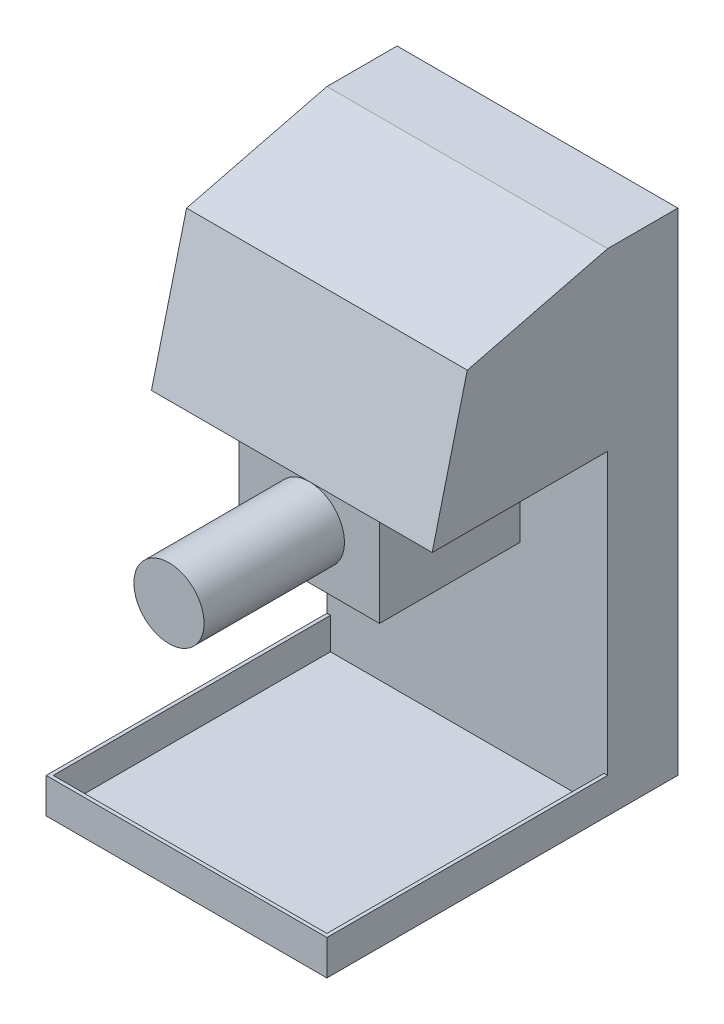
ISO-10303-21;
HEADER;
FILE_DESCRIPTION(('STEP AP214'),'2;1');
FILE_NAME('part.step','',(''),(''),'','','');
FILE_SCHEMA(('AUTOMOTIVE_DESIGN { 1 0 10303 214 1 1 1 1 }'));
ENDSEC;
DATA;
#1=APPLICATION_CONTEXT('core data for automotive mechanical design processes');
#2=APPLICATION_PROTOCOL_DEFINITION('international standard','automotive_design',2000,#1);
#3=PRODUCT_CONTEXT('',#1,'mechanical');
#4=PRODUCT('Part','Part','',(#3));
#5=PRODUCT_RELATED_PRODUCT_CATEGORY('part','',(#4));
#6=PRODUCT_DEFINITION_FORMATION('','',#4);
#7=PRODUCT_DEFINITION_CONTEXT('part definition',#1,'design');
#8=PRODUCT_DEFINITION('design','',#6,#7);
#9=PRODUCT_DEFINITION_SHAPE('','',#8);
#10=(LENGTH_UNIT() NAMED_UNIT(*) SI_UNIT(.MILLI.,.METRE.));
#11=(NAMED_UNIT(*) PLANE_ANGLE_UNIT() SI_UNIT($,.RADIAN.));
#12=(NAMED_UNIT(*) SI_UNIT($,.STERADIAN.) SOLID_ANGLE_UNIT());
#13=UNCERTAINTY_MEASURE_WITH_UNIT(LENGTH_MEASURE(1.E-05),#10,'distance_accuracy_value','');
#14=(GEOMETRIC_REPRESENTATION_CONTEXT(3) GLOBAL_UNCERTAINTY_ASSIGNED_CONTEXT((#13)) GLOBAL_UNIT_ASSIGNED_CONTEXT((#10,
#11,#12)) REPRESENTATION_CONTEXT('',''));
#15=CARTESIAN_POINT('',(0.,0.,0.));
#16=DIRECTION('',(0.,0.,1.));
#17=DIRECTION('',(1.,0.,0.));
#18=AXIS2_PLACEMENT_3D('',#15,#16,#17);
#19=CARTESIAN_POINT('',(60.,60.,65.));
#20=DIRECTION('',(0.,0.,-1.));
#21=DIRECTION('',(-1.,0.,0.));
#22=AXIS2_PLACEMENT_3D('',#19,#20,#21);
#23=PLANE('',#22);
#24=DIRECTION('',(-1.,0.,0.));
#25=VECTOR('',#24,1.);
#26=CARTESIAN_POINT('',(60.,90.,65.));
#27=LINE('',#26,#25);
#28=CARTESIAN_POINT('',(60.,90.,65.));
#29=VERTEX_POINT('',#28);
#30=CARTESIAN_POINT('',(20.,90.,65.));
#31=VERTEX_POINT('',#30);
#32=EDGE_CURVE('E60',#29,#31,#27,.T.);
#33=ORIENTED_EDGE('',*,*,#32,.T.);
#34=DIRECTION('',(0.,1.,0.));
#35=VECTOR('',#34,1.);
#36=CARTESIAN_POINT('',(20.,60.,65.));
#37=LINE('',#36,#35);
#38=CARTESIAN_POINT('',(20.,60.,65.));
#39=VERTEX_POINT('',#38);
#40=EDGE_CURVE('E226',#39,#31,#37,.T.);
#41=ORIENTED_EDGE('',*,*,#40,.F.);
#42=DIRECTION('',(-1.,0.,0.));
#43=VECTOR('',#42,1.);
#44=CARTESIAN_POINT('',(60.,60.,65.));
#45=LINE('',#44,#43);
#46=CARTESIAN_POINT('',(60.,60.,65.));
#47=VERTEX_POINT('',#46);
#48=EDGE_CURVE('E286',#47,#39,#45,.T.);
#49=ORIENTED_EDGE('',*,*,#48,.F.);
#50=DIRECTION('',(0.,1.,0.));
#51=VECTOR('',#50,1.);
#52=CARTESIAN_POINT('',(60.,60.,65.));
#53=LINE('',#52,#51);
#54=EDGE_CURVE('E222',#47,#29,#53,.T.);
#55=ORIENTED_EDGE('',*,*,#54,.T.);
#56=EDGE_LOOP('',(#33,#41,#49,#55));
#57=FACE_BOUND('',#56,.T.);
#58=CARTESIAN_POINT('',(40.,75.,65.));
#59=DIRECTION('',(0.,0.,-1.));
#60=DIRECTION('',(-1.,0.,0.));
#61=AXIS2_PLACEMENT_3D('',#58,#59,#60);
#62=CIRCLE('',#61,10.);
#63=CARTESIAN_POINT('',(30.,75.,65.));
#64=VERTEX_POINT('',#63);
#65=EDGE_CURVE('E12',#64,#64,#62,.F.);
#66=ORIENTED_EDGE('',*,*,#65,.F.);
#67=EDGE_LOOP('',(#66));
#68=FACE_BOUND('',#67,.T.);
#69=ADVANCED_FACE('F37',(#57,#68),#23,.F.);
#70=CARTESIAN_POINT('',(80.,90.,70.));
#71=DIRECTION('',(0.,1.,0.));
#72=DIRECTION('',(0.,0.,1.));
#73=AXIS2_PLACEMENT_3D('',#70,#71,#72);
#74=PLANE('',#73);
#75=DIRECTION('',(0.,0.,-1.));
#76=VECTOR('',#75,1.);
#77=CARTESIAN_POINT('',(0.,90.,70.));
#78=LINE('',#77,#76);
#79=CARTESIAN_POINT('',(0.,90.,70.));
#80=VERTEX_POINT('',#79);
#81=CARTESIAN_POINT('',(0.,90.,20.));
#82=VERTEX_POINT('',#81);
#83=EDGE_CURVE('E237',#80,#82,#78,.T.);
#84=ORIENTED_EDGE('',*,*,#83,.T.);
#85=DIRECTION('',(-1.,0.,0.));
#86=VECTOR('',#85,1.);
#87=CARTESIAN_POINT('',(80.,90.,20.));
#88=LINE('',#87,#86);
#89=CARTESIAN_POINT('',(80.,90.,20.));
#90=VERTEX_POINT('',#89);
#91=EDGE_CURVE('E187',#90,#82,#88,.T.);
#92=ORIENTED_EDGE('',*,*,#91,.F.);
#93=DIRECTION('',(0.,0.,-1.));
#94=VECTOR('',#93,1.);
#95=CARTESIAN_POINT('',(80.,90.,70.));
#96=LINE('',#95,#94);
#97=CARTESIAN_POINT('',(80.,90.,70.));
#98=VERTEX_POINT('',#97);
#99=EDGE_CURVE('E250',#98,#90,#96,.T.);
#100=ORIENTED_EDGE('',*,*,#99,.F.);
#101=DIRECTION('',(-1.,0.,0.));
#102=VECTOR('',#101,1.);
#103=CARTESIAN_POINT('',(80.,90.,70.));
#104=LINE('',#103,#102);
#105=EDGE_CURVE('E194',#98,#80,#104,.T.);
#106=ORIENTED_EDGE('',*,*,#105,.T.);
#107=EDGE_LOOP('',(#84,#92,#100,#106));
#108=FACE_BOUND('',#107,.T.);
#109=DIRECTION('',(0.,0.,1.));
#110=VECTOR('',#109,1.);
#111=CARTESIAN_POINT('',(60.,90.,65.));
#112=LINE('',#111,#110);
#113=CARTESIAN_POINT('',(60.,90.,25.));
#114=VERTEX_POINT('',#113);
#115=EDGE_CURVE('E279',#114,#29,#112,.T.);
#116=ORIENTED_EDGE('',*,*,#115,.F.);
#117=DIRECTION('',(1.,0.,0.));
#118=VECTOR('',#117,1.);
#119=CARTESIAN_POINT('',(60.,90.,25.));
#120=LINE('',#119,#118);
#121=CARTESIAN_POINT('',(20.,90.,25.));
#122=VERTEX_POINT('',#121);
#123=EDGE_CURVE('E271',#122,#114,#120,.T.);
#124=ORIENTED_EDGE('',*,*,#123,.F.);
#125=DIRECTION('',(0.,0.,-1.));
#126=VECTOR('',#125,1.);
#127=CARTESIAN_POINT('',(20.,90.,65.));
#128=LINE('',#127,#126);
#129=EDGE_CURVE('E275',#31,#122,#128,.T.);
#130=ORIENTED_EDGE('',*,*,#129,.F.);
#131=ORIENTED_EDGE('',*,*,#32,.F.);
#132=EDGE_LOOP('',(#116,#124,#130,#131));
#133=FACE_BOUND('',#132,.T.);
#134=ADVANCED_FACE('F335',(#108,#133),#74,.F.);
#135=CARTESIAN_POINT('',(80.,0.,100.));
#136=DIRECTION('',(0.,1.,0.));
#137=DIRECTION('',(0.,0.,1.));
#138=AXIS2_PLACEMENT_3D('',#135,#136,#137);
#139=PLANE('',#138);
#140=DIRECTION('',(0.,0.,-1.));
#141=VECTOR('',#140,1.);
#142=CARTESIAN_POINT('',(0.,0.,100.));
#143=LINE('',#142,#141);
#144=CARTESIAN_POINT('',(0.,0.,100.));
#145=VERTEX_POINT('',#144);
#146=CARTESIAN_POINT('',(0.,0.,0.));
#147=VERTEX_POINT('',#146);
#148=EDGE_CURVE('E218',#145,#147,#143,.T.);
#149=ORIENTED_EDGE('',*,*,#148,.T.);
#150=DIRECTION('',(-1.,0.,0.));
#151=VECTOR('',#150,1.);
#152=CARTESIAN_POINT('',(80.,0.,0.));
#153=LINE('',#152,#151);
#154=CARTESIAN_POINT('',(80.,0.,0.));
#155=VERTEX_POINT('',#154);
#156=EDGE_CURVE('E45',#155,#147,#153,.T.);
#157=ORIENTED_EDGE('',*,*,#156,.F.);
#158=DIRECTION('',(0.,0.,-1.));
#159=VECTOR('',#158,1.);
#160=CARTESIAN_POINT('',(80.,0.,100.));
#161=LINE('',#160,#159);
#162=CARTESIAN_POINT('',(80.,0.,100.));
#163=VERTEX_POINT('',#162);
#164=EDGE_CURVE('E243',#163,#155,#161,.T.);
#165=ORIENTED_EDGE('',*,*,#164,.F.);
#166=DIRECTION('',(-1.,0.,0.));
#167=VECTOR('',#166,1.);
#168=CARTESIAN_POINT('',(80.,0.,100.));
#169=LINE('',#168,#167);
#170=EDGE_CURVE('E189',#163,#145,#169,.T.);
#171=ORIENTED_EDGE('',*,*,#170,.T.);
#172=EDGE_LOOP('',(#149,#157,#165,#171));
#173=FACE_BOUND('',#172,.T.);
#174=ADVANCED_FACE('F39',(#173),#139,.F.);
#175=CARTESIAN_POINT('',(80.,0.,0.));
#176=DIRECTION('',(0.,0.,1.));
#177=DIRECTION('',(1.,0.,0.));
#178=AXIS2_PLACEMENT_3D('',#175,#176,#177);
#179=PLANE('',#178);
#180=DIRECTION('',(0.,1.,0.));
#181=VECTOR('',#180,1.);
#182=CARTESIAN_POINT('',(0.,0.,0.));
#183=LINE('',#182,#181);
#184=CARTESIAN_POINT('',(0.,140.,0.));
#185=VERTEX_POINT('',#184);
#186=EDGE_CURVE('E211',#147,#185,#183,.T.);
#187=ORIENTED_EDGE('',*,*,#186,.T.);
#188=DIRECTION('',(-1.,0.,0.));
#189=VECTOR('',#188,1.);
#190=CARTESIAN_POINT('',(80.,140.,0.));
#191=LINE('',#190,#189);
#192=CARTESIAN_POINT('',(80.,140.,0.));
#193=VERTEX_POINT('',#192);
#194=EDGE_CURVE('E203',#193,#185,#191,.T.);
#195=ORIENTED_EDGE('',*,*,#194,.F.);
#196=DIRECTION('',(0.,1.,0.));
#197=VECTOR('',#196,1.);
#198=CARTESIAN_POINT('',(80.,0.,0.));
#199=LINE('',#198,#197);
#200=EDGE_CURVE('E212',#155,#193,#199,.T.);
#201=ORIENTED_EDGE('',*,*,#200,.F.);
#202=ORIENTED_EDGE('',*,*,#156,.T.);
#203=EDGE_LOOP('',(#187,#195,#201,#202));
#204=FACE_BOUND('',#203,.T.);
#205=ADVANCED_FACE('F209',(#204),#179,.F.);
#206=CARTESIAN_POINT('',(80.,140.,0.));
#207=DIRECTION('',(0.,-1.,0.));
#208=DIRECTION('',(0.,0.,-1.));
#209=AXIS2_PLACEMENT_3D('',#206,#207,#208);
#210=PLANE('',#209);
#211=DIRECTION('',(0.,0.,1.));
#212=VECTOR('',#211,1.);
#213=CARTESIAN_POINT('',(0.,140.,0.));
#214=LINE('',#213,#212);
#215=CARTESIAN_POINT('',(0.,140.,20.));
#216=VERTEX_POINT('',#215);
#217=EDGE_CURVE('E224',#185,#216,#214,.T.);
#218=ORIENTED_EDGE('',*,*,#217,.T.);
#219=DIRECTION('',(-1.,0.,0.));
#220=VECTOR('',#219,1.);
#221=CARTESIAN_POINT('',(80.,140.,20.));
#222=LINE('',#221,#220);
#223=CARTESIAN_POINT('',(80.,140.,20.));
#224=VERTEX_POINT('',#223);
#225=EDGE_CURVE('E200',#224,#216,#222,.T.);
#226=ORIENTED_EDGE('',*,*,#225,.F.);
#227=DIRECTION('',(0.,0.,1.));
#228=VECTOR('',#227,1.);
#229=CARTESIAN_POINT('',(80.,140.,0.));
#230=LINE('',#229,#228);
#231=EDGE_CURVE('E258',#193,#224,#230,.T.);
#232=ORIENTED_EDGE('',*,*,#231,.F.);
#233=ORIENTED_EDGE('',*,*,#194,.T.);
#234=EDGE_LOOP('',(#218,#226,#232,#233));
#235=FACE_BOUND('',#234,.T.);
#236=ADVANCED_FACE('F320',(#235),#210,.F.);
#237=CARTESIAN_POINT('',(80.,140.,20.));
#238=DIRECTION('',(0.,-0.970142500145332,-0.242535625036333));
#239=DIRECTION('',(0.,0.242535625036333,-0.970142500145332));
#240=AXIS2_PLACEMENT_3D('',#237,#238,#239);
#241=PLANE('',#240);
#242=DIRECTION('',(0.,-0.242535625036333,0.970142500145332));
#243=VECTOR('',#242,1.);
#244=CARTESIAN_POINT('',(0.,140.,20.));
#245=LINE('',#244,#243);
#246=CARTESIAN_POINT('',(0.,130.,60.));
#247=VERTEX_POINT('',#246);
#248=EDGE_CURVE('E233',#216,#247,#245,.T.);
#249=ORIENTED_EDGE('',*,*,#248,.T.);
#250=DIRECTION('',(-1.,0.,0.));
#251=VECTOR('',#250,1.);
#252=CARTESIAN_POINT('',(80.,130.,60.));
#253=LINE('',#252,#251);
#254=CARTESIAN_POINT('',(80.,130.,60.));
#255=VERTEX_POINT('',#254);
#256=EDGE_CURVE('E197',#255,#247,#253,.T.);
#257=ORIENTED_EDGE('',*,*,#256,.F.);
#258=DIRECTION('',(0.,-0.242535625036333,0.970142500145332));
#259=VECTOR('',#258,1.);
#260=CARTESIAN_POINT('',(80.,140.,20.));
#261=LINE('',#260,#259);
#262=EDGE_CURVE('E256',#224,#255,#261,.T.);
#263=ORIENTED_EDGE('',*,*,#262,.F.);
#264=ORIENTED_EDGE('',*,*,#225,.T.);
#265=EDGE_LOOP('',(#249,#257,#263,#264));
#266=FACE_BOUND('',#265,.T.);
#267=ADVANCED_FACE('F325',(#266),#241,.F.);
#268=CARTESIAN_POINT('',(80.,130.,60.));
#269=DIRECTION('',(0.,-0.242535625036332,-0.970142500145332));
#270=DIRECTION('',(0.,0.970142500145332,-0.242535625036332));
#271=AXIS2_PLACEMENT_3D('',#268,#269,#270);
#272=PLANE('',#271);
#273=DIRECTION('',(0.,-0.970142500145332,0.242535625036332));
#274=VECTOR('',#273,1.);
#275=CARTESIAN_POINT('',(0.,130.,60.));
#276=LINE('',#275,#274);
#277=EDGE_CURVE('E235',#247,#80,#276,.T.);
#278=ORIENTED_EDGE('',*,*,#277,.T.);
#279=ORIENTED_EDGE('',*,*,#105,.F.);
#280=DIRECTION('',(0.,-0.970142500145332,0.242535625036332));
#281=VECTOR('',#280,1.);
#282=CARTESIAN_POINT('',(80.,130.,60.));
#283=LINE('',#282,#281);
#284=EDGE_CURVE('E254',#255,#98,#283,.T.);
#285=ORIENTED_EDGE('',*,*,#284,.F.);
#286=ORIENTED_EDGE('',*,*,#256,.T.);
#287=EDGE_LOOP('',(#278,#279,#285,#286));
#288=FACE_BOUND('',#287,.T.);
#289=ADVANCED_FACE('F331',(#288),#272,.F.);
#290=CARTESIAN_POINT('',(80.,90.,20.));
#291=DIRECTION('',(0.,0.,-1.));
#292=DIRECTION('',(0.,1.,0.));
#293=AXIS2_PLACEMENT_3D('',#290,#291,#292);
#294=PLANE('',#293);
#295=DIRECTION('',(0.,-1.,0.));
#296=VECTOR('',#295,1.);
#297=CARTESIAN_POINT('',(0.,90.,20.));
#298=LINE('',#297,#296);
#299=CARTESIAN_POINT('',(0.,10.,20.));
#300=VERTEX_POINT('',#299);
#301=EDGE_CURVE('E182',#82,#300,#298,.T.);
#302=ORIENTED_EDGE('',*,*,#301,.T.);
#303=DIRECTION('',(-1.,0.,0.));
#304=VECTOR('',#303,1.);
#305=CARTESIAN_POINT('',(80.,10.,20.));
#306=LINE('',#305,#304);
#307=CARTESIAN_POINT('',(1.,10.,20.));
#308=VERTEX_POINT('',#307);
#309=EDGE_CURVE('E174',#308,#300,#306,.T.);
#310=ORIENTED_EDGE('',*,*,#309,.F.);
#311=DIRECTION('',(0.,1.,0.));
#312=VECTOR('',#311,1.);
#313=CARTESIAN_POINT('',(1.,-111.018016555873,20.));
#314=LINE('',#313,#312);
#315=CARTESIAN_POINT('',(1.,1.,20.));
#316=VERTEX_POINT('',#315);
#317=EDGE_CURVE('E157',#316,#308,#314,.T.);
#318=ORIENTED_EDGE('',*,*,#317,.F.);
#319=DIRECTION('',(1.,0.,0.));
#320=VECTOR('',#319,1.);
#321=CARTESIAN_POINT('',(79.,1.,20.));
#322=LINE('',#321,#320);
#323=CARTESIAN_POINT('',(79.,1.,20.));
#324=VERTEX_POINT('',#323);
#325=EDGE_CURVE('E292',#316,#324,#322,.T.);
#326=ORIENTED_EDGE('',*,*,#325,.T.);
#327=DIRECTION('',(0.,1.,0.));
#328=VECTOR('',#327,1.);
#329=CARTESIAN_POINT('',(79.,-111.018016555873,20.));
#330=LINE('',#329,#328);
#331=CARTESIAN_POINT('',(79.,10.,20.));
#332=VERTEX_POINT('',#331);
#333=EDGE_CURVE('E169',#324,#332,#330,.T.);
#334=ORIENTED_EDGE('',*,*,#333,.T.);
#335=CARTESIAN_POINT('',(80.,10.,20.));
#336=VERTEX_POINT('',#335);
#337=EDGE_CURVE('E184',#336,#332,#306,.T.);
#338=ORIENTED_EDGE('',*,*,#337,.F.);
#339=DIRECTION('',(0.,-1.,0.));
#340=VECTOR('',#339,1.);
#341=CARTESIAN_POINT('',(80.,90.,20.));
#342=LINE('',#341,#340);
#343=EDGE_CURVE('E247',#90,#336,#342,.T.);
#344=ORIENTED_EDGE('',*,*,#343,.F.);
#345=ORIENTED_EDGE('',*,*,#91,.T.);
#346=EDGE_LOOP('',(#302,#310,#318,#326,#334,#338,#344,#345));
#347=FACE_BOUND('',#346,.T.);
#348=ADVANCED_FACE('F179',(#347),#294,.F.);
#349=CARTESIAN_POINT('',(80.,10.,20.));
#350=DIRECTION('',(0.,-1.,0.));
#351=DIRECTION('',(0.,0.,-1.));
#352=AXIS2_PLACEMENT_3D('',#349,#350,#351);
#353=PLANE('',#352);
#354=ORIENTED_EDGE('',*,*,#337,.T.);
#355=DIRECTION('',(0.,0.,-1.));
#356=VECTOR('',#355,1.);
#357=CARTESIAN_POINT('',(79.,10.,20.));
#358=LINE('',#357,#356);
#359=CARTESIAN_POINT('',(79.,10.,99.));
#360=VERTEX_POINT('',#359);
#361=EDGE_CURVE('E52',#360,#332,#358,.T.);
#362=ORIENTED_EDGE('',*,*,#361,.F.);
#363=DIRECTION('',(1.,0.,0.));
#364=VECTOR('',#363,1.);
#365=CARTESIAN_POINT('',(79.,10.,99.));
#366=LINE('',#365,#364);
#367=CARTESIAN_POINT('',(1.00000000000001,10.,99.));
#368=VERTEX_POINT('',#367);
#369=EDGE_CURVE('E177',#368,#360,#366,.T.);
#370=ORIENTED_EDGE('',*,*,#369,.F.);
#371=DIRECTION('',(0.,0.,1.));
#372=VECTOR('',#371,1.);
#373=CARTESIAN_POINT('',(1.,10.,20.));
#374=LINE('',#373,#372);
#375=EDGE_CURVE('E161',#308,#368,#374,.T.);
#376=ORIENTED_EDGE('',*,*,#375,.F.);
#377=ORIENTED_EDGE('',*,*,#309,.T.);
#378=DIRECTION('',(0.,0.,1.));
#379=VECTOR('',#378,1.);
#380=CARTESIAN_POINT('',(0.,10.,20.));
#381=LINE('',#380,#379);
#382=CARTESIAN_POINT('',(0.,10.,100.));
#383=VERTEX_POINT('',#382);
#384=EDGE_CURVE('E240',#300,#383,#381,.T.);
#385=ORIENTED_EDGE('',*,*,#384,.T.);
#386=DIRECTION('',(-1.,0.,0.));
#387=VECTOR('',#386,1.);
#388=CARTESIAN_POINT('',(80.,10.,100.));
#389=LINE('',#388,#387);
#390=CARTESIAN_POINT('',(80.,10.,100.));
#391=VERTEX_POINT('',#390);
#392=EDGE_CURVE('E185',#391,#383,#389,.T.);
#393=ORIENTED_EDGE('',*,*,#392,.F.);
#394=DIRECTION('',(0.,0.,1.));
#395=VECTOR('',#394,1.);
#396=CARTESIAN_POINT('',(80.,10.,20.));
#397=LINE('',#396,#395);
#398=EDGE_CURVE('E244',#336,#391,#397,.T.);
#399=ORIENTED_EDGE('',*,*,#398,.F.);
#400=EDGE_LOOP('',(#354,#362,#370,#376,#377,#385,#393,#399));
#401=FACE_BOUND('',#400,.T.);
#402=ADVANCED_FACE('F173',(#401),#353,.F.);
#403=CARTESIAN_POINT('',(80.,10.,100.));
#404=DIRECTION('',(0.,0.,-1.));
#405=DIRECTION('',(-1.,0.,0.));
#406=AXIS2_PLACEMENT_3D('',#403,#404,#405);
#407=PLANE('',#406);
#408=DIRECTION('',(0.,-1.,0.));
#409=VECTOR('',#408,1.);
#410=CARTESIAN_POINT('',(0.,10.,100.));
#411=LINE('',#410,#409);
#412=EDGE_CURVE('E242',#383,#145,#411,.T.);
#413=ORIENTED_EDGE('',*,*,#412,.T.);
#414=ORIENTED_EDGE('',*,*,#170,.F.);
#415=DIRECTION('',(0.,-1.,0.));
#416=VECTOR('',#415,1.);
#417=CARTESIAN_POINT('',(80.,10.,100.));
#418=LINE('',#417,#416);
#419=EDGE_CURVE('E229',#391,#163,#418,.T.);
#420=ORIENTED_EDGE('',*,*,#419,.F.);
#421=ORIENTED_EDGE('',*,*,#392,.T.);
#422=EDGE_LOOP('',(#413,#414,#420,#421));
#423=FACE_BOUND('',#422,.T.);
#424=ADVANCED_FACE('F314',(#423),#407,.F.);
#425=CARTESIAN_POINT('',(80.,0.,0.));
#426=DIRECTION('',(1.,0.,0.));
#427=DIRECTION('',(0.,0.,-1.));
#428=AXIS2_PLACEMENT_3D('',#425,#426,#427);
#429=PLANE('',#428);
#430=ORIENTED_EDGE('',*,*,#164,.T.);
#431=ORIENTED_EDGE('',*,*,#200,.T.);
#432=ORIENTED_EDGE('',*,*,#231,.T.);
#433=ORIENTED_EDGE('',*,*,#262,.T.);
#434=ORIENTED_EDGE('',*,*,#284,.T.);
#435=ORIENTED_EDGE('',*,*,#99,.T.);
#436=ORIENTED_EDGE('',*,*,#343,.T.);
#437=ORIENTED_EDGE('',*,*,#398,.T.);
#438=ORIENTED_EDGE('',*,*,#419,.T.);
#439=EDGE_LOOP('',(#430,#431,#432,#433,#434,#435,#436,#437,#438));
#440=FACE_BOUND('',#439,.T.);
#441=ADVANCED_FACE('F315',(#440),#429,.T.);
#442=CARTESIAN_POINT('',(0.,0.,0.));
#443=DIRECTION('',(1.,0.,0.));
#444=DIRECTION('',(0.,0.,-1.));
#445=AXIS2_PLACEMENT_3D('',#442,#443,#444);
#446=PLANE('',#445);
#447=ORIENTED_EDGE('',*,*,#148,.F.);
#448=ORIENTED_EDGE('',*,*,#412,.F.);
#449=ORIENTED_EDGE('',*,*,#384,.F.);
#450=ORIENTED_EDGE('',*,*,#301,.F.);
#451=ORIENTED_EDGE('',*,*,#83,.F.);
#452=ORIENTED_EDGE('',*,*,#277,.F.);
#453=ORIENTED_EDGE('',*,*,#248,.F.);
#454=ORIENTED_EDGE('',*,*,#217,.F.);
#455=ORIENTED_EDGE('',*,*,#186,.F.);
#456=EDGE_LOOP('',(#447,#448,#449,#450,#451,#452,#453,#454,#455));
#457=FACE_BOUND('',#456,.T.);
#458=ADVANCED_FACE('F336',(#457),#446,.F.);
#459=CARTESIAN_POINT('',(60.,60.,65.));
#460=DIRECTION('',(-1.,0.,0.));
#461=DIRECTION('',(0.,0.,1.));
#462=AXIS2_PLACEMENT_3D('',#459,#460,#461);
#463=PLANE('',#462);
#464=ORIENTED_EDGE('',*,*,#115,.T.);
#465=ORIENTED_EDGE('',*,*,#54,.F.);
#466=DIRECTION('',(0.,0.,1.));
#467=VECTOR('',#466,1.);
#468=CARTESIAN_POINT('',(60.,60.,65.));
#469=LINE('',#468,#467);
#470=CARTESIAN_POINT('',(60.,60.,25.));
#471=VERTEX_POINT('',#470);
#472=EDGE_CURVE('E274',#471,#47,#469,.T.);
#473=ORIENTED_EDGE('',*,*,#472,.F.);
#474=DIRECTION('',(0.,1.,0.));
#475=VECTOR('',#474,1.);
#476=CARTESIAN_POINT('',(60.,60.,25.));
#477=LINE('',#476,#475);
#478=EDGE_CURVE('E267',#471,#114,#477,.T.);
#479=ORIENTED_EDGE('',*,*,#478,.T.);
#480=EDGE_LOOP('',(#464,#465,#473,#479));
#481=FACE_BOUND('',#480,.T.);
#482=ADVANCED_FACE('F338',(#481),#463,.F.);
#483=CARTESIAN_POINT('',(20.,60.,65.));
#484=DIRECTION('',(1.,0.,0.));
#485=DIRECTION('',(0.,0.,-1.));
#486=AXIS2_PLACEMENT_3D('',#483,#484,#485);
#487=PLANE('',#486);
#488=ORIENTED_EDGE('',*,*,#129,.T.);
#489=DIRECTION('',(0.,1.,0.));
#490=VECTOR('',#489,1.);
#491=CARTESIAN_POINT('',(20.,60.,25.));
#492=LINE('',#491,#490);
#493=CARTESIAN_POINT('',(20.,60.,25.));
#494=VERTEX_POINT('',#493);
#495=EDGE_CURVE('E264',#494,#122,#492,.T.);
#496=ORIENTED_EDGE('',*,*,#495,.F.);
#497=DIRECTION('',(0.,0.,-1.));
#498=VECTOR('',#497,1.);
#499=CARTESIAN_POINT('',(20.,60.,65.));
#500=LINE('',#499,#498);
#501=EDGE_CURVE('E284',#39,#494,#500,.T.);
#502=ORIENTED_EDGE('',*,*,#501,.F.);
#503=ORIENTED_EDGE('',*,*,#40,.T.);
#504=EDGE_LOOP('',(#488,#496,#502,#503));
#505=FACE_BOUND('',#504,.T.);
#506=ADVANCED_FACE('F344',(#505),#487,.F.);
#507=CARTESIAN_POINT('',(60.,60.,25.));
#508=DIRECTION('',(0.,0.,1.));
#509=DIRECTION('',(1.,0.,0.));
#510=AXIS2_PLACEMENT_3D('',#507,#508,#509);
#511=PLANE('',#510);
#512=ORIENTED_EDGE('',*,*,#123,.T.);
#513=ORIENTED_EDGE('',*,*,#478,.F.);
#514=DIRECTION('',(1.,0.,0.));
#515=VECTOR('',#514,1.);
#516=CARTESIAN_POINT('',(60.,60.,25.));
#517=LINE('',#516,#515);
#518=EDGE_CURVE('E270',#494,#471,#517,.T.);
#519=ORIENTED_EDGE('',*,*,#518,.F.);
#520=ORIENTED_EDGE('',*,*,#495,.T.);
#521=EDGE_LOOP('',(#512,#513,#519,#520));
#522=FACE_BOUND('',#521,.T.);
#523=ADVANCED_FACE('F360',(#522),#511,.F.);
#524=CARTESIAN_POINT('',(0.,60.,0.));
#525=DIRECTION('',(0.,1.,0.));
#526=DIRECTION('',(0.,0.,1.));
#527=AXIS2_PLACEMENT_3D('',#524,#525,#526);
#528=PLANE('',#527);
#529=ORIENTED_EDGE('',*,*,#472,.T.);
#530=ORIENTED_EDGE('',*,*,#48,.T.);
#531=ORIENTED_EDGE('',*,*,#501,.T.);
#532=ORIENTED_EDGE('',*,*,#518,.T.);
#533=EDGE_LOOP('',(#529,#530,#531,#532));
#534=FACE_BOUND('',#533,.T.);
#535=ADVANCED_FACE('F364',(#534),#528,.F.);
#536=CARTESIAN_POINT('',(40.,75.,105.));
#537=DIRECTION('',(0.,0.,-1.));
#538=DIRECTION('',(-1.,0.,0.));
#539=AXIS2_PLACEMENT_3D('',#536,#537,#538);
#540=CYLINDRICAL_SURFACE('',#539,10.);
#541=CARTESIAN_POINT('',(40.,75.,105.));
#542=DIRECTION('',(0.,0.,1.));
#543=DIRECTION('',(1.,0.,0.));
#544=AXIS2_PLACEMENT_3D('',#541,#542,#543);
#545=CIRCLE('',#544,10.);
#546=CARTESIAN_POINT('',(50.,75.,105.));
#547=VERTEX_POINT('',#546);
#548=EDGE_CURVE('E282',#547,#547,#545,.T.);
#549=ORIENTED_EDGE('',*,*,#548,.F.);
#550=EDGE_LOOP('',(#549));
#551=FACE_BOUND('',#550,.T.);
#552=ORIENTED_EDGE('',*,*,#65,.T.);
#553=EDGE_LOOP('',(#552));
#554=FACE_BOUND('',#553,.T.);
#555=ADVANCED_FACE('F368',(#551,#554),#540,.T.);
#556=CARTESIAN_POINT('',(40.,75.,105.));
#557=DIRECTION('',(0.,0.,1.));
#558=DIRECTION('',(1.,0.,0.));
#559=AXIS2_PLACEMENT_3D('',#556,#557,#558);
#560=PLANE('',#559);
#561=ORIENTED_EDGE('',*,*,#548,.T.);
#562=EDGE_LOOP('',(#561));
#563=FACE_BOUND('',#562,.T.);
#564=ADVANCED_FACE('F372',(#563),#560,.T.);
#565=CARTESIAN_POINT('',(79.,-111.018016555873,20.));
#566=DIRECTION('',(1.,0.,0.));
#567=DIRECTION('',(0.,0.,-1.));
#568=AXIS2_PLACEMENT_3D('',#565,#566,#567);
#569=PLANE('',#568);
#570=DIRECTION('',(0.,0.,1.));
#571=VECTOR('',#570,1.);
#572=CARTESIAN_POINT('',(79.,1.,20.));
#573=LINE('',#572,#571);
#574=CARTESIAN_POINT('',(79.,1.,99.));
#575=VERTEX_POINT('',#574);
#576=EDGE_CURVE('E294',#324,#575,#573,.T.);
#577=ORIENTED_EDGE('',*,*,#576,.T.);
#578=DIRECTION('',(0.,1.,0.));
#579=VECTOR('',#578,1.);
#580=CARTESIAN_POINT('',(79.,-111.018016555873,99.));
#581=LINE('',#580,#579);
#582=EDGE_CURVE('E297',#575,#360,#581,.T.);
#583=ORIENTED_EDGE('',*,*,#582,.T.);
#584=ORIENTED_EDGE('',*,*,#361,.T.);
#585=ORIENTED_EDGE('',*,*,#333,.F.);
#586=EDGE_LOOP('',(#577,#583,#584,#585));
#587=FACE_BOUND('',#586,.T.);
#588=ADVANCED_FACE('F376',(#587),#569,.F.);
#589=CARTESIAN_POINT('',(79.,-111.018016555873,99.));
#590=DIRECTION('',(0.,0.,1.));
#591=DIRECTION('',(1.,0.,0.));
#592=AXIS2_PLACEMENT_3D('',#589,#590,#591);
#593=PLANE('',#592);
#594=DIRECTION('',(-1.,0.,0.));
#595=VECTOR('',#594,1.);
#596=CARTESIAN_POINT('',(79.,1.,99.));
#597=LINE('',#596,#595);
#598=CARTESIAN_POINT('',(1.00000000000001,1.,99.));
#599=VERTEX_POINT('',#598);
#600=EDGE_CURVE('E302',#575,#599,#597,.T.);
#601=ORIENTED_EDGE('',*,*,#600,.T.);
#602=DIRECTION('',(0.,1.,0.));
#603=VECTOR('',#602,1.);
#604=CARTESIAN_POINT('',(1.00000000000001,-111.018016555873,99.));
#605=LINE('',#604,#603);
#606=EDGE_CURVE('E168',#599,#368,#605,.T.);
#607=ORIENTED_EDGE('',*,*,#606,.T.);
#608=ORIENTED_EDGE('',*,*,#369,.T.);
#609=ORIENTED_EDGE('',*,*,#582,.F.);
#610=EDGE_LOOP('',(#601,#607,#608,#609));
#611=FACE_BOUND('',#610,.T.);
#612=ADVANCED_FACE('F307',(#611),#593,.F.);
#613=CARTESIAN_POINT('',(1.,-111.018016555873,20.));
#614=DIRECTION('',(-1.,0.,0.));
#615=DIRECTION('',(0.,0.,1.));
#616=AXIS2_PLACEMENT_3D('',#613,#614,#615);
#617=PLANE('',#616);
#618=DIRECTION('',(0.,0.,-1.));
#619=VECTOR('',#618,1.);
#620=CARTESIAN_POINT('',(1.,1.,20.));
#621=LINE('',#620,#619);
#622=EDGE_CURVE('E164',#599,#316,#621,.T.);
#623=ORIENTED_EDGE('',*,*,#622,.T.);
#624=ORIENTED_EDGE('',*,*,#317,.T.);
#625=ORIENTED_EDGE('',*,*,#375,.T.);
#626=ORIENTED_EDGE('',*,*,#606,.F.);
#627=EDGE_LOOP('',(#623,#624,#625,#626));
#628=FACE_BOUND('',#627,.T.);
#629=ADVANCED_FACE('F159',(#628),#617,.F.);
#630=CARTESIAN_POINT('',(80.,1.,100.));
#631=DIRECTION('',(0.,1.,0.));
#632=DIRECTION('',(0.,0.,1.));
#633=AXIS2_PLACEMENT_3D('',#630,#631,#632);
#634=PLANE('',#633);
#635=ORIENTED_EDGE('',*,*,#576,.F.);
#636=ORIENTED_EDGE('',*,*,#325,.F.);
#637=ORIENTED_EDGE('',*,*,#622,.F.);
#638=ORIENTED_EDGE('',*,*,#600,.F.);
#639=EDGE_LOOP('',(#635,#636,#637,#638));
#640=FACE_BOUND('',#639,.T.);
#641=ADVANCED_FACE('F310',(#640),#634,.T.);
#642=CLOSED_SHELL('',(#69,#134,#174,#205,#236,#267,#289,#348,#402,#424,#441,#458,#482,#506,#523,
#535,#555,#564,#588,#612,#629,#641));
#643=MANIFOLD_SOLID_BREP('B2',#642);
#644=ADVANCED_BREP_SHAPE_REPRESENTATION('',(#18,#643),#14);
#645=SHAPE_DEFINITION_REPRESENTATION(#9,#644);
ENDSEC;
END-ISO-10303-21;
